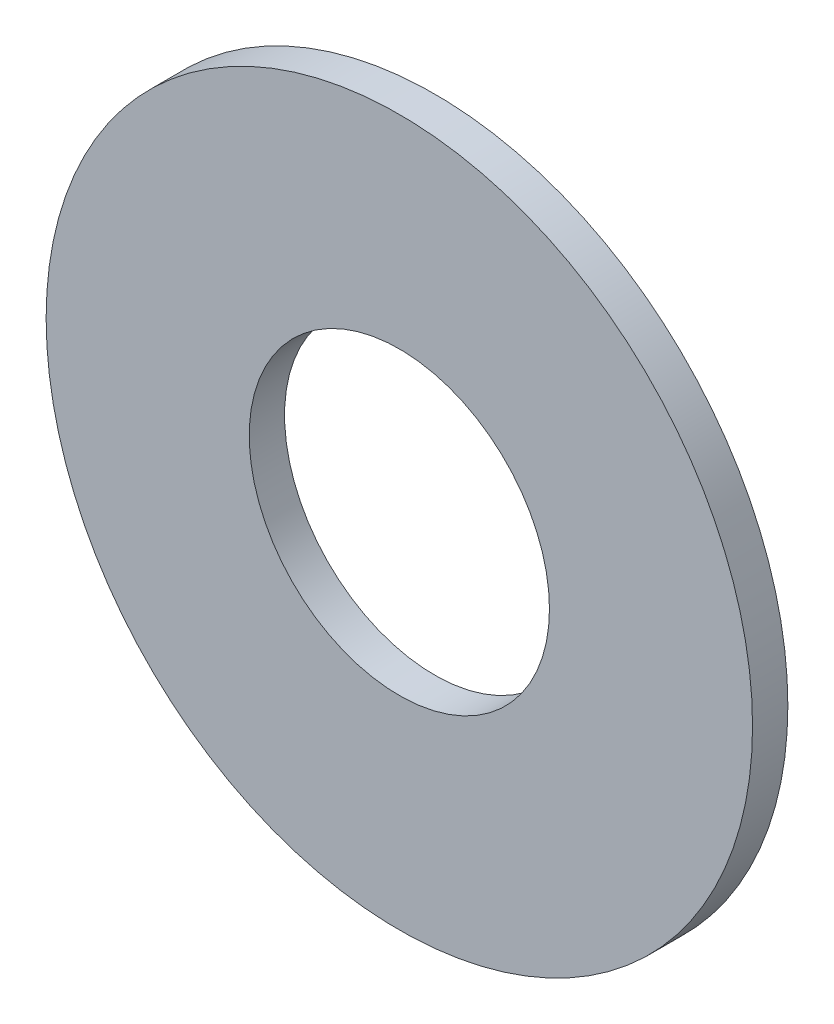
ISO-10303-21;
HEADER;
FILE_DESCRIPTION(('STEP AP214'),'2;1');
FILE_NAME('part.step','',(''),(''),'','','');
FILE_SCHEMA(('AUTOMOTIVE_DESIGN { 1 0 10303 214 1 1 1 1 }'));
ENDSEC;
DATA;
#1=APPLICATION_CONTEXT('core data for automotive mechanical design processes');
#2=APPLICATION_PROTOCOL_DEFINITION('international standard','automotive_design',2000,#1);
#3=PRODUCT_CONTEXT('',#1,'mechanical');
#4=PRODUCT('Part','Part','',(#3));
#5=PRODUCT_RELATED_PRODUCT_CATEGORY('part','',(#4));
#6=PRODUCT_DEFINITION_FORMATION('','',#4);
#7=PRODUCT_DEFINITION_CONTEXT('part definition',#1,'design');
#8=PRODUCT_DEFINITION('design','',#6,#7);
#9=PRODUCT_DEFINITION_SHAPE('','',#8);
#10=(LENGTH_UNIT() NAMED_UNIT(*) SI_UNIT(.MILLI.,.METRE.));
#11=(NAMED_UNIT(*) PLANE_ANGLE_UNIT() SI_UNIT($,.RADIAN.));
#12=(NAMED_UNIT(*) SI_UNIT($,.STERADIAN.) SOLID_ANGLE_UNIT());
#13=UNCERTAINTY_MEASURE_WITH_UNIT(LENGTH_MEASURE(1.E-05),#10,'distance_accuracy_value','');
#14=(GEOMETRIC_REPRESENTATION_CONTEXT(3) GLOBAL_UNCERTAINTY_ASSIGNED_CONTEXT((#13)) GLOBAL_UNIT_ASSIGNED_CONTEXT((#10,
#11,#12)) REPRESENTATION_CONTEXT('',''));
#15=CARTESIAN_POINT('',(0.,0.,0.));
#16=DIRECTION('',(0.,0.,1.));
#17=DIRECTION('',(1.,0.,0.));
#18=AXIS2_PLACEMENT_3D('',#15,#16,#17);
#19=CARTESIAN_POINT('',(0.,0.,1.));
#20=DIRECTION('',(0.,0.,1.));
#21=DIRECTION('',(1.,0.,0.));
#22=AXIS2_PLACEMENT_3D('',#19,#20,#21);
#23=PLANE('',#22);
#24=CARTESIAN_POINT('',(0.,0.,1.));
#25=DIRECTION('',(0.,0.,1.));
#26=DIRECTION('',(1.,0.,0.));
#27=AXIS2_PLACEMENT_3D('',#24,#25,#26);
#28=CIRCLE('',#27,10.);
#29=CARTESIAN_POINT('',(10.,0.,1.));
#30=VERTEX_POINT('',#29);
#31=EDGE_CURVE('E11',#30,#30,#28,.T.);
#32=ORIENTED_EDGE('',*,*,#31,.T.);
#33=EDGE_LOOP('',(#32));
#34=FACE_BOUND('',#33,.T.);
#35=CARTESIAN_POINT('',(0.,0.,1.));
#36=DIRECTION('',(0.,0.,1.));
#37=DIRECTION('',(1.,0.,0.));
#38=AXIS2_PLACEMENT_3D('',#35,#36,#37);
#39=CIRCLE('',#38,4.25);
#40=CARTESIAN_POINT('',(4.25,0.,1.));
#41=VERTEX_POINT('',#40);
#42=EDGE_CURVE('E56',#41,#41,#39,.T.);
#43=ORIENTED_EDGE('',*,*,#42,.F.);
#44=EDGE_LOOP('',(#43));
#45=FACE_BOUND('',#44,.T.);
#46=ADVANCED_FACE('F43',(#34,#45),#23,.T.);
#47=CARTESIAN_POINT('',(0.,0.,0.));
#48=DIRECTION('',(0.,0.,1.));
#49=DIRECTION('',(1.,0.,0.));
#50=AXIS2_PLACEMENT_3D('',#47,#48,#49);
#51=PLANE('',#50);
#52=CARTESIAN_POINT('',(0.,0.,0.));
#53=DIRECTION('',(0.,0.,1.));
#54=DIRECTION('',(1.,0.,0.));
#55=AXIS2_PLACEMENT_3D('',#52,#53,#54);
#56=CIRCLE('',#55,10.);
#57=CARTESIAN_POINT('',(10.,0.,0.));
#58=VERTEX_POINT('',#57);
#59=EDGE_CURVE('E47',#58,#58,#56,.T.);
#60=ORIENTED_EDGE('',*,*,#59,.F.);
#61=EDGE_LOOP('',(#60));
#62=FACE_BOUND('',#61,.T.);
#63=CARTESIAN_POINT('',(0.,0.,0.));
#64=DIRECTION('',(0.,0.,1.));
#65=DIRECTION('',(1.,0.,0.));
#66=AXIS2_PLACEMENT_3D('',#63,#64,#65);
#67=CIRCLE('',#66,4.25);
#68=CARTESIAN_POINT('',(4.25,0.,0.));
#69=VERTEX_POINT('',#68);
#70=EDGE_CURVE('E58',#69,#69,#67,.T.);
#71=ORIENTED_EDGE('',*,*,#70,.T.);
#72=EDGE_LOOP('',(#71));
#73=FACE_BOUND('',#72,.T.);
#74=ADVANCED_FACE('F70',(#62,#73),#51,.F.);
#75=CARTESIAN_POINT('',(0.,0.,1.));
#76=DIRECTION('',(0.,0.,-1.));
#77=DIRECTION('',(-1.,0.,0.));
#78=AXIS2_PLACEMENT_3D('',#75,#76,#77);
#79=CYLINDRICAL_SURFACE('',#78,10.);
#80=ORIENTED_EDGE('',*,*,#31,.F.);
#81=EDGE_LOOP('',(#80));
#82=FACE_BOUND('',#81,.T.);
#83=ORIENTED_EDGE('',*,*,#59,.T.);
#84=EDGE_LOOP('',(#83));
#85=FACE_BOUND('',#84,.T.);
#86=ADVANCED_FACE('F45',(#82,#85),#79,.T.);
#87=CARTESIAN_POINT('',(0.,0.,1.));
#88=DIRECTION('',(0.,0.,-1.));
#89=DIRECTION('',(-1.,0.,0.));
#90=AXIS2_PLACEMENT_3D('',#87,#88,#89);
#91=CYLINDRICAL_SURFACE('',#90,4.25);
#92=ORIENTED_EDGE('',*,*,#42,.T.);
#93=EDGE_LOOP('',(#92));
#94=FACE_BOUND('',#93,.T.);
#95=ORIENTED_EDGE('',*,*,#70,.F.);
#96=EDGE_LOOP('',(#95));
#97=FACE_BOUND('',#96,.T.);
#98=ADVANCED_FACE('F66',(#94,#97),#91,.F.);
#99=CLOSED_SHELL('',(#46,#74,#86,#98));
#100=MANIFOLD_SOLID_BREP('B2',#99);
#101=ADVANCED_BREP_SHAPE_REPRESENTATION('',(#18,#100),#14);
#102=SHAPE_DEFINITION_REPRESENTATION(#9,#101);
ENDSEC;
END-ISO-10303-21;
